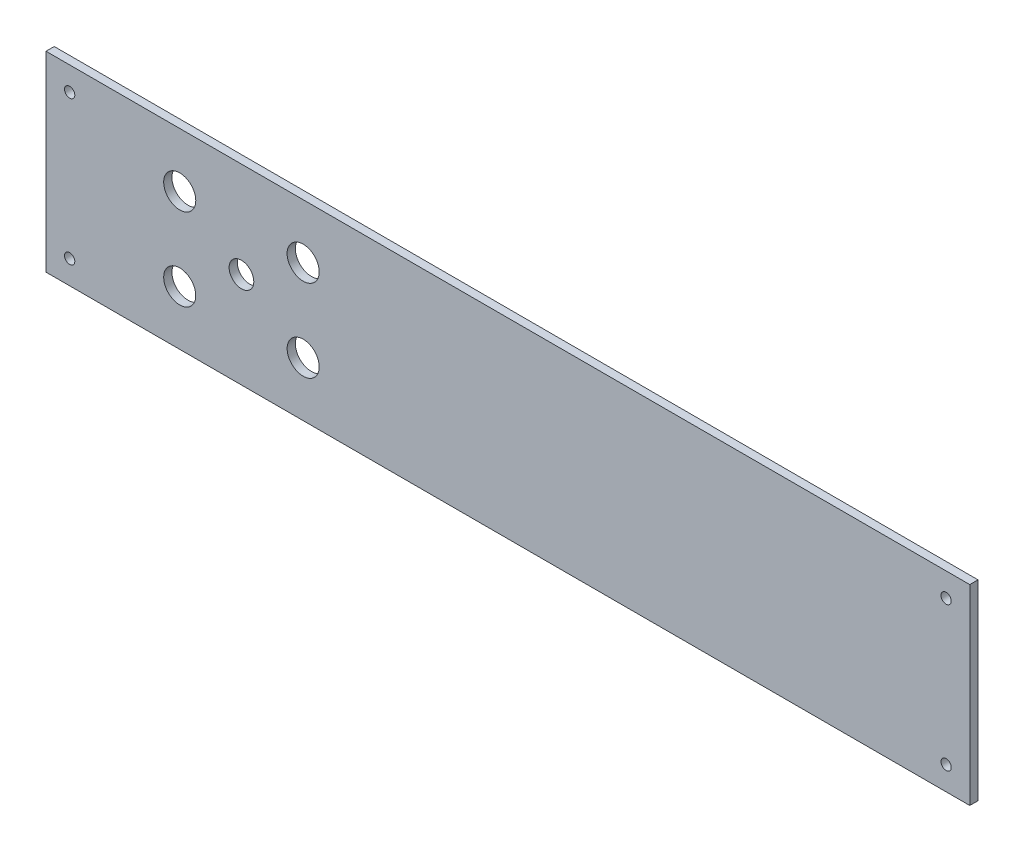
ISO-10303-21;
HEADER;
FILE_DESCRIPTION(('STEP AP214'),'2;1');
FILE_NAME('part.step','',(''),(''),'','','');
FILE_SCHEMA(('AUTOMOTIVE_DESIGN { 1 0 10303 214 1 1 1 1 }'));
ENDSEC;
DATA;
#1=APPLICATION_CONTEXT('core data for automotive mechanical design processes');
#2=APPLICATION_PROTOCOL_DEFINITION('international standard','automotive_design',2000,#1);
#3=PRODUCT_CONTEXT('',#1,'mechanical');
#4=PRODUCT('Part','Part','',(#3));
#5=PRODUCT_RELATED_PRODUCT_CATEGORY('part','',(#4));
#6=PRODUCT_DEFINITION_FORMATION('','',#4);
#7=PRODUCT_DEFINITION_CONTEXT('part definition',#1,'design');
#8=PRODUCT_DEFINITION('design','',#6,#7);
#9=PRODUCT_DEFINITION_SHAPE('','',#8);
#10=(LENGTH_UNIT() NAMED_UNIT(*) SI_UNIT(.MILLI.,.METRE.));
#11=(NAMED_UNIT(*) PLANE_ANGLE_UNIT() SI_UNIT($,.RADIAN.));
#12=(NAMED_UNIT(*) SI_UNIT($,.STERADIAN.) SOLID_ANGLE_UNIT());
#13=UNCERTAINTY_MEASURE_WITH_UNIT(LENGTH_MEASURE(1.E-05),#10,'distance_accuracy_value','');
#14=(GEOMETRIC_REPRESENTATION_CONTEXT(3) GLOBAL_UNCERTAINTY_ASSIGNED_CONTEXT((#13)) GLOBAL_UNIT_ASSIGNED_CONTEXT((#10,
#11,#12)) REPRESENTATION_CONTEXT('',''));
#15=CARTESIAN_POINT('',(0.,0.,0.));
#16=DIRECTION('',(0.,0.,1.));
#17=DIRECTION('',(1.,0.,0.));
#18=AXIS2_PLACEMENT_3D('',#15,#16,#17);
#19=CARTESIAN_POINT('',(0.,0.,4.));
#20=DIRECTION('',(0.,0.,1.));
#21=DIRECTION('',(1.,0.,0.));
#22=AXIS2_PLACEMENT_3D('',#19,#20,#21);
#23=PLANE('',#22);
#24=CARTESIAN_POINT('',(-324.,66.4999999999999,4.));
#25=DIRECTION('',(0.,0.,1.));
#26=DIRECTION('',(-1.,0.,0.));
#27=AXIS2_PLACEMENT_3D('',#24,#25,#26);
#28=CIRCLE('',#27,7.79999999999999);
#29=CARTESIAN_POINT('',(-331.8,66.4999999999999,4.));
#30=VERTEX_POINT('',#29);
#31=EDGE_CURVE('E153',#30,#30,#28,.T.);
#32=ORIENTED_EDGE('',*,*,#31,.F.);
#33=EDGE_LOOP('',(#32));
#34=FACE_BOUND('',#33,.T.);
#35=CARTESIAN_POINT('',(-324.,26.4999999999999,4.));
#36=DIRECTION('',(0.,0.,1.));
#37=DIRECTION('',(1.,0.,0.));
#38=AXIS2_PLACEMENT_3D('',#35,#36,#37);
#39=CIRCLE('',#38,7.79999999999999);
#40=CARTESIAN_POINT('',(-316.2,26.4999999999999,4.));
#41=VERTEX_POINT('',#40);
#42=EDGE_CURVE('E141',#41,#41,#39,.T.);
#43=ORIENTED_EDGE('',*,*,#42,.F.);
#44=EDGE_LOOP('',(#43));
#45=FACE_BOUND('',#44,.T.);
#46=CARTESIAN_POINT('',(-11.5,11.5000000000001,4.));
#47=DIRECTION('',(0.,0.,1.));
#48=DIRECTION('',(1.,0.,0.));
#49=AXIS2_PLACEMENT_3D('',#46,#47,#48);
#50=CIRCLE('',#49,2.50000000000002);
#51=CARTESIAN_POINT('',(-8.99999999999993,11.5000000000001,4.));
#52=VERTEX_POINT('',#51);
#53=EDGE_CURVE('E129',#52,#52,#50,.T.);
#54=ORIENTED_EDGE('',*,*,#53,.F.);
#55=EDGE_LOOP('',(#54));
#56=FACE_BOUND('',#55,.T.);
#57=CARTESIAN_POINT('',(-384.,26.4999999999999,4.));
#58=DIRECTION('',(0.,0.,1.));
#59=DIRECTION('',(-1.,0.,0.));
#60=AXIS2_PLACEMENT_3D('',#57,#58,#59);
#61=CIRCLE('',#60,7.79999999999999);
#62=CARTESIAN_POINT('',(-391.8,26.4999999999999,4.));
#63=VERTEX_POINT('',#62);
#64=EDGE_CURVE('E117',#63,#63,#61,.T.);
#65=ORIENTED_EDGE('',*,*,#64,.F.);
#66=EDGE_LOOP('',(#65));
#67=FACE_BOUND('',#66,.T.);
#68=DIRECTION('',(0.,1.,0.));
#69=VECTOR('',#68,1.);
#70=CARTESIAN_POINT('',(0.,0.,4.));
#71=LINE('',#70,#69);
#72=CARTESIAN_POINT('',(0.,0.,4.));
#73=VERTEX_POINT('',#72);
#74=CARTESIAN_POINT('',(0.,92.9999999999999,4.));
#75=VERTEX_POINT('',#74);
#76=EDGE_CURVE('E87',#73,#75,#71,.T.);
#77=ORIENTED_EDGE('',*,*,#76,.T.);
#78=DIRECTION('',(-1.,0.,0.));
#79=VECTOR('',#78,1.);
#80=CARTESIAN_POINT('',(0.,92.9999999999999,4.));
#81=LINE('',#80,#79);
#82=CARTESIAN_POINT('',(-449.,92.9999999999999,4.));
#83=VERTEX_POINT('',#82);
#84=EDGE_CURVE('E82',#75,#83,#81,.T.);
#85=ORIENTED_EDGE('',*,*,#84,.T.);
#86=DIRECTION('',(0.,-1.,0.));
#87=VECTOR('',#86,1.);
#88=CARTESIAN_POINT('',(-449.,0.,4.));
#89=LINE('',#88,#87);
#90=CARTESIAN_POINT('',(-449.,0.,4.));
#91=VERTEX_POINT('',#90);
#92=EDGE_CURVE('E85',#83,#91,#89,.T.);
#93=ORIENTED_EDGE('',*,*,#92,.T.);
#94=DIRECTION('',(1.,0.,0.));
#95=VECTOR('',#94,1.);
#96=CARTESIAN_POINT('',(0.,0.,4.));
#97=LINE('',#96,#95);
#98=EDGE_CURVE('E52',#91,#73,#97,.T.);
#99=ORIENTED_EDGE('',*,*,#98,.T.);
#100=EDGE_LOOP('',(#77,#85,#93,#99));
#101=FACE_BOUND('',#100,.T.);
#102=CARTESIAN_POINT('',(-437.5,81.4999999999999,4.));
#103=DIRECTION('',(0.,0.,1.));
#104=DIRECTION('',(1.,0.,0.));
#105=AXIS2_PLACEMENT_3D('',#102,#103,#104);
#106=CIRCLE('',#105,2.50000000000002);
#107=CARTESIAN_POINT('',(-435.,81.4999999999999,4.));
#108=VERTEX_POINT('',#107);
#109=EDGE_CURVE('E102',#108,#108,#106,.T.);
#110=ORIENTED_EDGE('',*,*,#109,.F.);
#111=EDGE_LOOP('',(#110));
#112=FACE_BOUND('',#111,.T.);
#113=CARTESIAN_POINT('',(-11.5,81.4999999999998,4.));
#114=DIRECTION('',(0.,0.,1.));
#115=DIRECTION('',(-1.,0.,0.));
#116=AXIS2_PLACEMENT_3D('',#113,#114,#115);
#117=CIRCLE('',#116,2.50000000000002);
#118=CARTESIAN_POINT('',(-14.,81.4999999999998,4.));
#119=VERTEX_POINT('',#118);
#120=EDGE_CURVE('E123',#119,#119,#117,.T.);
#121=ORIENTED_EDGE('',*,*,#120,.F.);
#122=EDGE_LOOP('',(#121));
#123=FACE_BOUND('',#122,.T.);
#124=CARTESIAN_POINT('',(-437.5,11.4999999999999,4.));
#125=DIRECTION('',(0.,0.,1.));
#126=DIRECTION('',(-1.,0.,0.));
#127=AXIS2_PLACEMENT_3D('',#124,#125,#126);
#128=CIRCLE('',#127,2.50000000000002);
#129=CARTESIAN_POINT('',(-440.,11.4999999999999,4.));
#130=VERTEX_POINT('',#129);
#131=EDGE_CURVE('E135',#130,#130,#128,.T.);
#132=ORIENTED_EDGE('',*,*,#131,.F.);
#133=EDGE_LOOP('',(#132));
#134=FACE_BOUND('',#133,.T.);
#135=CARTESIAN_POINT('',(-384.,66.4999999999999,4.));
#136=DIRECTION('',(0.,0.,1.));
#137=DIRECTION('',(1.,0.,0.));
#138=AXIS2_PLACEMENT_3D('',#135,#136,#137);
#139=CIRCLE('',#138,7.79999999999999);
#140=CARTESIAN_POINT('',(-376.2,66.4999999999999,4.));
#141=VERTEX_POINT('',#140);
#142=EDGE_CURVE('E147',#141,#141,#139,.T.);
#143=ORIENTED_EDGE('',*,*,#142,.F.);
#144=EDGE_LOOP('',(#143));
#145=FACE_BOUND('',#144,.T.);
#146=CARTESIAN_POINT('',(-354.,46.4999999999999,4.));
#147=DIRECTION('',(0.,0.,1.));
#148=DIRECTION('',(1.,0.,0.));
#149=AXIS2_PLACEMENT_3D('',#146,#147,#148);
#150=CIRCLE('',#149,5.99999999999999);
#151=CARTESIAN_POINT('',(-348.,46.4999999999999,4.));
#152=VERTEX_POINT('',#151);
#153=EDGE_CURVE('E159',#152,#152,#150,.T.);
#154=ORIENTED_EDGE('',*,*,#153,.F.);
#155=EDGE_LOOP('',(#154));
#156=FACE_BOUND('',#155,.T.);
#157=ADVANCED_FACE('F35',(#34,#45,#56,#67,#101,#112,#123,#134,#145,#156),#23,.T.);
#158=CARTESIAN_POINT('',(0.,0.,0.));
#159=DIRECTION('',(0.,0.,1.));
#160=DIRECTION('',(1.,0.,0.));
#161=AXIS2_PLACEMENT_3D('',#158,#159,#160);
#162=PLANE('',#161);
#163=DIRECTION('',(0.,1.,0.));
#164=VECTOR('',#163,1.);
#165=CARTESIAN_POINT('',(0.,0.,0.));
#166=LINE('',#165,#164);
#167=CARTESIAN_POINT('',(0.,0.,0.));
#168=VERTEX_POINT('',#167);
#169=CARTESIAN_POINT('',(0.,92.9999999999999,0.));
#170=VERTEX_POINT('',#169);
#171=EDGE_CURVE('E99',#168,#170,#166,.T.);
#172=ORIENTED_EDGE('',*,*,#171,.F.);
#173=DIRECTION('',(1.,0.,0.));
#174=VECTOR('',#173,1.);
#175=CARTESIAN_POINT('',(0.,0.,0.));
#176=LINE('',#175,#174);
#177=CARTESIAN_POINT('',(-449.,0.,0.));
#178=VERTEX_POINT('',#177);
#179=EDGE_CURVE('E75',#178,#168,#176,.T.);
#180=ORIENTED_EDGE('',*,*,#179,.F.);
#181=DIRECTION('',(0.,-1.,0.));
#182=VECTOR('',#181,1.);
#183=CARTESIAN_POINT('',(-449.,0.,0.));
#184=LINE('',#183,#182);
#185=CARTESIAN_POINT('',(-449.,92.9999999999999,0.));
#186=VERTEX_POINT('',#185);
#187=EDGE_CURVE('E69',#186,#178,#184,.T.);
#188=ORIENTED_EDGE('',*,*,#187,.F.);
#189=DIRECTION('',(-1.,0.,0.));
#190=VECTOR('',#189,1.);
#191=CARTESIAN_POINT('',(0.,92.9999999999999,0.));
#192=LINE('',#191,#190);
#193=EDGE_CURVE('E91',#170,#186,#192,.T.);
#194=ORIENTED_EDGE('',*,*,#193,.F.);
#195=EDGE_LOOP('',(#172,#180,#188,#194));
#196=FACE_BOUND('',#195,.T.);
#197=CARTESIAN_POINT('',(-437.5,81.4999999999999,0.));
#198=DIRECTION('',(0.,0.,1.));
#199=DIRECTION('',(1.,0.,0.));
#200=AXIS2_PLACEMENT_3D('',#197,#198,#199);
#201=CIRCLE('',#200,2.50000000000002);
#202=CARTESIAN_POINT('',(-435.,81.4999999999999,0.));
#203=VERTEX_POINT('',#202);
#204=EDGE_CURVE('E114',#203,#203,#201,.T.);
#205=ORIENTED_EDGE('',*,*,#204,.T.);
#206=EDGE_LOOP('',(#205));
#207=FACE_BOUND('',#206,.T.);
#208=CARTESIAN_POINT('',(-384.,26.4999999999999,0.));
#209=DIRECTION('',(0.,0.,1.));
#210=DIRECTION('',(-1.,0.,0.));
#211=AXIS2_PLACEMENT_3D('',#208,#209,#210);
#212=CIRCLE('',#211,7.79999999999999);
#213=CARTESIAN_POINT('',(-391.8,26.4999999999999,0.));
#214=VERTEX_POINT('',#213);
#215=EDGE_CURVE('E120',#214,#214,#212,.T.);
#216=ORIENTED_EDGE('',*,*,#215,.T.);
#217=EDGE_LOOP('',(#216));
#218=FACE_BOUND('',#217,.T.);
#219=CARTESIAN_POINT('',(-11.5,81.4999999999998,0.));
#220=DIRECTION('',(0.,0.,1.));
#221=DIRECTION('',(-1.,0.,0.));
#222=AXIS2_PLACEMENT_3D('',#219,#220,#221);
#223=CIRCLE('',#222,2.50000000000002);
#224=CARTESIAN_POINT('',(-14.,81.4999999999998,0.));
#225=VERTEX_POINT('',#224);
#226=EDGE_CURVE('E126',#225,#225,#223,.T.);
#227=ORIENTED_EDGE('',*,*,#226,.T.);
#228=EDGE_LOOP('',(#227));
#229=FACE_BOUND('',#228,.T.);
#230=CARTESIAN_POINT('',(-11.5,11.5000000000001,0.));
#231=DIRECTION('',(0.,0.,1.));
#232=DIRECTION('',(1.,0.,0.));
#233=AXIS2_PLACEMENT_3D('',#230,#231,#232);
#234=CIRCLE('',#233,2.50000000000002);
#235=CARTESIAN_POINT('',(-8.99999999999993,11.5000000000001,0.));
#236=VERTEX_POINT('',#235);
#237=EDGE_CURVE('E132',#236,#236,#234,.T.);
#238=ORIENTED_EDGE('',*,*,#237,.T.);
#239=EDGE_LOOP('',(#238));
#240=FACE_BOUND('',#239,.T.);
#241=CARTESIAN_POINT('',(-437.5,11.4999999999999,0.));
#242=DIRECTION('',(0.,0.,1.));
#243=DIRECTION('',(-1.,0.,0.));
#244=AXIS2_PLACEMENT_3D('',#241,#242,#243);
#245=CIRCLE('',#244,2.50000000000002);
#246=CARTESIAN_POINT('',(-440.,11.4999999999999,0.));
#247=VERTEX_POINT('',#246);
#248=EDGE_CURVE('E138',#247,#247,#245,.T.);
#249=ORIENTED_EDGE('',*,*,#248,.T.);
#250=EDGE_LOOP('',(#249));
#251=FACE_BOUND('',#250,.T.);
#252=CARTESIAN_POINT('',(-324.,26.4999999999999,0.));
#253=DIRECTION('',(0.,0.,1.));
#254=DIRECTION('',(1.,0.,0.));
#255=AXIS2_PLACEMENT_3D('',#252,#253,#254);
#256=CIRCLE('',#255,7.79999999999999);
#257=CARTESIAN_POINT('',(-316.2,26.4999999999999,0.));
#258=VERTEX_POINT('',#257);
#259=EDGE_CURVE('E144',#258,#258,#256,.T.);
#260=ORIENTED_EDGE('',*,*,#259,.T.);
#261=EDGE_LOOP('',(#260));
#262=FACE_BOUND('',#261,.T.);
#263=CARTESIAN_POINT('',(-384.,66.4999999999999,0.));
#264=DIRECTION('',(0.,0.,1.));
#265=DIRECTION('',(1.,0.,0.));
#266=AXIS2_PLACEMENT_3D('',#263,#264,#265);
#267=CIRCLE('',#266,7.79999999999999);
#268=CARTESIAN_POINT('',(-376.2,66.4999999999999,0.));
#269=VERTEX_POINT('',#268);
#270=EDGE_CURVE('E150',#269,#269,#267,.T.);
#271=ORIENTED_EDGE('',*,*,#270,.T.);
#272=EDGE_LOOP('',(#271));
#273=FACE_BOUND('',#272,.T.);
#274=CARTESIAN_POINT('',(-324.,66.4999999999999,0.));
#275=DIRECTION('',(0.,0.,1.));
#276=DIRECTION('',(-1.,0.,0.));
#277=AXIS2_PLACEMENT_3D('',#274,#275,#276);
#278=CIRCLE('',#277,7.79999999999999);
#279=CARTESIAN_POINT('',(-331.8,66.4999999999999,0.));
#280=VERTEX_POINT('',#279);
#281=EDGE_CURVE('E156',#280,#280,#278,.T.);
#282=ORIENTED_EDGE('',*,*,#281,.T.);
#283=EDGE_LOOP('',(#282));
#284=FACE_BOUND('',#283,.T.);
#285=CARTESIAN_POINT('',(-354.,46.4999999999999,0.));
#286=DIRECTION('',(0.,0.,1.));
#287=DIRECTION('',(1.,0.,0.));
#288=AXIS2_PLACEMENT_3D('',#285,#286,#287);
#289=CIRCLE('',#288,5.99999999999999);
#290=CARTESIAN_POINT('',(-348.,46.4999999999999,0.));
#291=VERTEX_POINT('',#290);
#292=EDGE_CURVE('E162',#291,#291,#289,.T.);
#293=ORIENTED_EDGE('',*,*,#292,.T.);
#294=EDGE_LOOP('',(#293));
#295=FACE_BOUND('',#294,.T.);
#296=ADVANCED_FACE('F110',(#196,#207,#218,#229,#240,#251,#262,#273,#284,#295),#162,.F.);
#297=CARTESIAN_POINT('',(0.,0.,4.));
#298=DIRECTION('',(-1.,0.,0.));
#299=DIRECTION('',(0.,0.,1.));
#300=AXIS2_PLACEMENT_3D('',#297,#298,#299);
#301=PLANE('',#300);
#302=ORIENTED_EDGE('',*,*,#171,.T.);
#303=DIRECTION('',(0.,0.,-1.));
#304=VECTOR('',#303,1.);
#305=CARTESIAN_POINT('',(0.,92.9999999999999,4.));
#306=LINE('',#305,#304);
#307=EDGE_CURVE('E11',#75,#170,#306,.T.);
#308=ORIENTED_EDGE('',*,*,#307,.F.);
#309=ORIENTED_EDGE('',*,*,#76,.F.);
#310=DIRECTION('',(0.,0.,-1.));
#311=VECTOR('',#310,1.);
#312=CARTESIAN_POINT('',(0.,0.,4.));
#313=LINE('',#312,#311);
#314=EDGE_CURVE('E95',#73,#168,#313,.T.);
#315=ORIENTED_EDGE('',*,*,#314,.T.);
#316=EDGE_LOOP('',(#302,#308,#309,#315));
#317=FACE_BOUND('',#316,.T.);
#318=ADVANCED_FACE('F37',(#317),#301,.F.);
#319=CARTESIAN_POINT('',(0.,92.9999999999999,4.));
#320=DIRECTION('',(0.,-1.,0.));
#321=DIRECTION('',(1.,0.,0.));
#322=AXIS2_PLACEMENT_3D('',#319,#320,#321);
#323=PLANE('',#322);
#324=ORIENTED_EDGE('',*,*,#193,.T.);
#325=DIRECTION('',(0.,0.,-1.));
#326=VECTOR('',#325,1.);
#327=CARTESIAN_POINT('',(-449.,92.9999999999999,4.));
#328=LINE('',#327,#326);
#329=EDGE_CURVE('E44',#83,#186,#328,.T.);
#330=ORIENTED_EDGE('',*,*,#329,.F.);
#331=ORIENTED_EDGE('',*,*,#84,.F.);
#332=ORIENTED_EDGE('',*,*,#307,.T.);
#333=EDGE_LOOP('',(#324,#330,#331,#332));
#334=FACE_BOUND('',#333,.T.);
#335=ADVANCED_FACE('F90',(#334),#323,.F.);
#336=CARTESIAN_POINT('',(-449.,0.,4.));
#337=DIRECTION('',(1.,0.,0.));
#338=DIRECTION('',(0.,1.,0.));
#339=AXIS2_PLACEMENT_3D('',#336,#337,#338);
#340=PLANE('',#339);
#341=ORIENTED_EDGE('',*,*,#187,.T.);
#342=DIRECTION('',(0.,0.,-1.));
#343=VECTOR('',#342,1.);
#344=CARTESIAN_POINT('',(-449.,0.,4.));
#345=LINE('',#344,#343);
#346=EDGE_CURVE('E92',#91,#178,#345,.T.);
#347=ORIENTED_EDGE('',*,*,#346,.F.);
#348=ORIENTED_EDGE('',*,*,#92,.F.);
#349=ORIENTED_EDGE('',*,*,#329,.T.);
#350=EDGE_LOOP('',(#341,#347,#348,#349));
#351=FACE_BOUND('',#350,.T.);
#352=ADVANCED_FACE('F93',(#351),#340,.F.);
#353=CARTESIAN_POINT('',(0.,0.,4.));
#354=DIRECTION('',(0.,1.,0.));
#355=DIRECTION('',(-1.,0.,0.));
#356=AXIS2_PLACEMENT_3D('',#353,#354,#355);
#357=PLANE('',#356);
#358=ORIENTED_EDGE('',*,*,#179,.T.);
#359=ORIENTED_EDGE('',*,*,#314,.F.);
#360=ORIENTED_EDGE('',*,*,#98,.F.);
#361=ORIENTED_EDGE('',*,*,#346,.T.);
#362=EDGE_LOOP('',(#358,#359,#360,#361));
#363=FACE_BOUND('',#362,.T.);
#364=ADVANCED_FACE('F107',(#363),#357,.F.);
#365=CARTESIAN_POINT('',(-437.5,81.4999999999999,4.));
#366=DIRECTION('',(0.,0.,-1.));
#367=DIRECTION('',(-1.,0.,0.));
#368=AXIS2_PLACEMENT_3D('',#365,#366,#367);
#369=CYLINDRICAL_SURFACE('',#368,2.50000000000002);
#370=ORIENTED_EDGE('',*,*,#109,.T.);
#371=EDGE_LOOP('',(#370));
#372=FACE_BOUND('',#371,.T.);
#373=ORIENTED_EDGE('',*,*,#204,.F.);
#374=EDGE_LOOP('',(#373));
#375=FACE_BOUND('',#374,.T.);
#376=ADVANCED_FACE('F181',(#372,#375),#369,.F.);
#377=CARTESIAN_POINT('',(-384.,26.4999999999999,4.));
#378=DIRECTION('',(0.,0.,-1.));
#379=DIRECTION('',(-1.,0.,0.));
#380=AXIS2_PLACEMENT_3D('',#377,#378,#379);
#381=CYLINDRICAL_SURFACE('',#380,7.79999999999999);
#382=ORIENTED_EDGE('',*,*,#64,.T.);
#383=EDGE_LOOP('',(#382));
#384=FACE_BOUND('',#383,.T.);
#385=ORIENTED_EDGE('',*,*,#215,.F.);
#386=EDGE_LOOP('',(#385));
#387=FACE_BOUND('',#386,.T.);
#388=ADVANCED_FACE('F229',(#384,#387),#381,.F.);
#389=CARTESIAN_POINT('',(-11.5,81.4999999999998,4.));
#390=DIRECTION('',(0.,0.,-1.));
#391=DIRECTION('',(-1.,0.,0.));
#392=AXIS2_PLACEMENT_3D('',#389,#390,#391);
#393=CYLINDRICAL_SURFACE('',#392,2.50000000000002);
#394=ORIENTED_EDGE('',*,*,#120,.T.);
#395=EDGE_LOOP('',(#394));
#396=FACE_BOUND('',#395,.T.);
#397=ORIENTED_EDGE('',*,*,#226,.F.);
#398=EDGE_LOOP('',(#397));
#399=FACE_BOUND('',#398,.T.);
#400=ADVANCED_FACE('F237',(#396,#399),#393,.F.);
#401=CARTESIAN_POINT('',(-11.5,11.5000000000001,4.));
#402=DIRECTION('',(0.,0.,-1.));
#403=DIRECTION('',(-1.,0.,0.));
#404=AXIS2_PLACEMENT_3D('',#401,#402,#403);
#405=CYLINDRICAL_SURFACE('',#404,2.50000000000002);
#406=ORIENTED_EDGE('',*,*,#53,.T.);
#407=EDGE_LOOP('',(#406));
#408=FACE_BOUND('',#407,.T.);
#409=ORIENTED_EDGE('',*,*,#237,.F.);
#410=EDGE_LOOP('',(#409));
#411=FACE_BOUND('',#410,.T.);
#412=ADVANCED_FACE('F245',(#408,#411),#405,.F.);
#413=CARTESIAN_POINT('',(-437.5,11.4999999999999,4.));
#414=DIRECTION('',(0.,0.,-1.));
#415=DIRECTION('',(-1.,0.,0.));
#416=AXIS2_PLACEMENT_3D('',#413,#414,#415);
#417=CYLINDRICAL_SURFACE('',#416,2.50000000000002);
#418=ORIENTED_EDGE('',*,*,#131,.T.);
#419=EDGE_LOOP('',(#418));
#420=FACE_BOUND('',#419,.T.);
#421=ORIENTED_EDGE('',*,*,#248,.F.);
#422=EDGE_LOOP('',(#421));
#423=FACE_BOUND('',#422,.T.);
#424=ADVANCED_FACE('F254',(#420,#423),#417,.F.);
#425=CARTESIAN_POINT('',(-324.,26.4999999999999,4.));
#426=DIRECTION('',(0.,0.,-1.));
#427=DIRECTION('',(-1.,0.,0.));
#428=AXIS2_PLACEMENT_3D('',#425,#426,#427);
#429=CYLINDRICAL_SURFACE('',#428,7.79999999999999);
#430=ORIENTED_EDGE('',*,*,#42,.T.);
#431=EDGE_LOOP('',(#430));
#432=FACE_BOUND('',#431,.T.);
#433=ORIENTED_EDGE('',*,*,#259,.F.);
#434=EDGE_LOOP('',(#433));
#435=FACE_BOUND('',#434,.T.);
#436=ADVANCED_FACE('F263',(#432,#435),#429,.F.);
#437=CARTESIAN_POINT('',(-384.,66.4999999999999,4.));
#438=DIRECTION('',(0.,0.,-1.));
#439=DIRECTION('',(-1.,0.,0.));
#440=AXIS2_PLACEMENT_3D('',#437,#438,#439);
#441=CYLINDRICAL_SURFACE('',#440,7.79999999999999);
#442=ORIENTED_EDGE('',*,*,#142,.T.);
#443=EDGE_LOOP('',(#442));
#444=FACE_BOUND('',#443,.T.);
#445=ORIENTED_EDGE('',*,*,#270,.F.);
#446=EDGE_LOOP('',(#445));
#447=FACE_BOUND('',#446,.T.);
#448=ADVANCED_FACE('F272',(#444,#447),#441,.F.);
#449=CARTESIAN_POINT('',(-324.,66.4999999999999,4.));
#450=DIRECTION('',(0.,0.,-1.));
#451=DIRECTION('',(-1.,0.,0.));
#452=AXIS2_PLACEMENT_3D('',#449,#450,#451);
#453=CYLINDRICAL_SURFACE('',#452,7.79999999999999);
#454=ORIENTED_EDGE('',*,*,#31,.T.);
#455=EDGE_LOOP('',(#454));
#456=FACE_BOUND('',#455,.T.);
#457=ORIENTED_EDGE('',*,*,#281,.F.);
#458=EDGE_LOOP('',(#457));
#459=FACE_BOUND('',#458,.T.);
#460=ADVANCED_FACE('F281',(#456,#459),#453,.F.);
#461=CARTESIAN_POINT('',(-354.,46.4999999999999,4.));
#462=DIRECTION('',(0.,0.,-1.));
#463=DIRECTION('',(-1.,0.,0.));
#464=AXIS2_PLACEMENT_3D('',#461,#462,#463);
#465=CYLINDRICAL_SURFACE('',#464,5.99999999999999);
#466=ORIENTED_EDGE('',*,*,#153,.T.);
#467=EDGE_LOOP('',(#466));
#468=FACE_BOUND('',#467,.T.);
#469=ORIENTED_EDGE('',*,*,#292,.F.);
#470=EDGE_LOOP('',(#469));
#471=FACE_BOUND('',#470,.T.);
#472=ADVANCED_FACE('F168',(#468,#471),#465,.F.);
#473=CLOSED_SHELL('',(#157,#296,#318,#335,#352,#364,#376,#388,#400,#412,#424,#436,#448,#460,#472));
#474=MANIFOLD_SOLID_BREP('B2',#473);
#475=ADVANCED_BREP_SHAPE_REPRESENTATION('',(#18,#474),#14);
#476=SHAPE_DEFINITION_REPRESENTATION(#9,#475);
ENDSEC;
END-ISO-10303-21;
